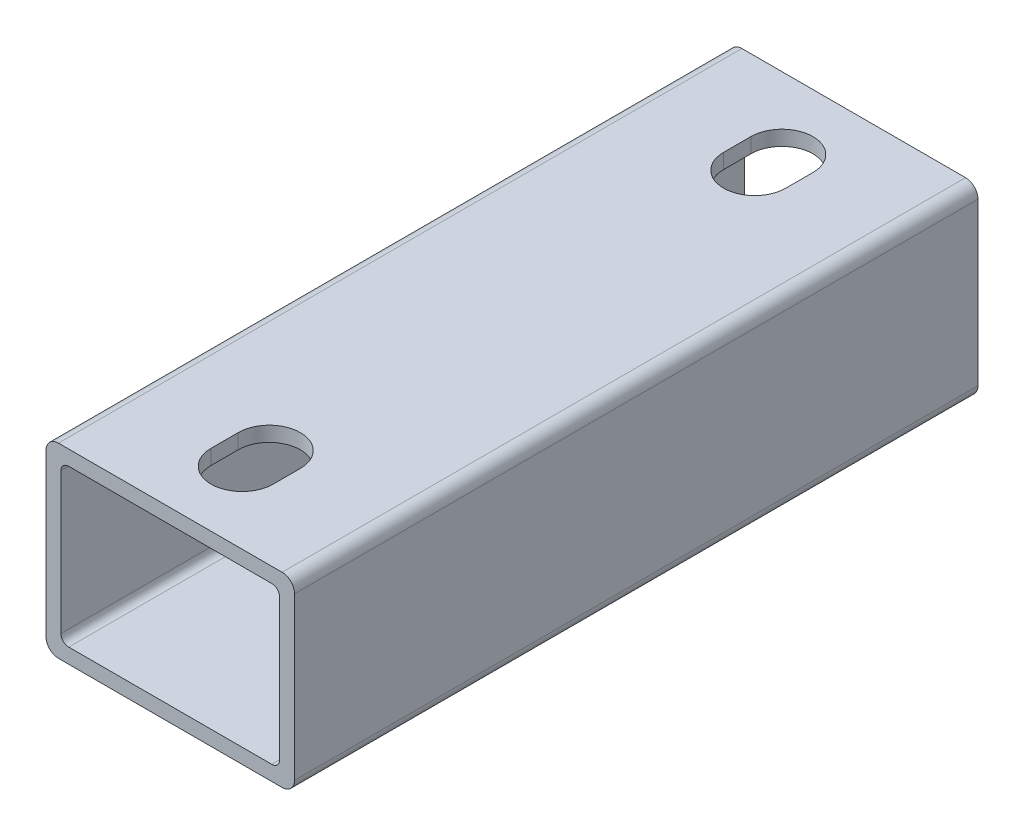
ISO-10303-21;
HEADER;
FILE_DESCRIPTION(('STEP AP214'),'2;1');
FILE_NAME('part.step','',(''),(''),'','','');
FILE_SCHEMA(('AUTOMOTIVE_DESIGN { 1 0 10303 214 1 1 1 1 }'));
ENDSEC;
DATA;
#1=APPLICATION_CONTEXT('core data for automotive mechanical design processes');
#2=APPLICATION_PROTOCOL_DEFINITION('international standard','automotive_design',2000,#1);
#3=PRODUCT_CONTEXT('',#1,'mechanical');
#4=PRODUCT('Part','Part','',(#3));
#5=PRODUCT_RELATED_PRODUCT_CATEGORY('part','',(#4));
#6=PRODUCT_DEFINITION_FORMATION('','',#4);
#7=PRODUCT_DEFINITION_CONTEXT('part definition',#1,'design');
#8=PRODUCT_DEFINITION('design','',#6,#7);
#9=PRODUCT_DEFINITION_SHAPE('','',#8);
#10=(LENGTH_UNIT() NAMED_UNIT(*) SI_UNIT(.MILLI.,.METRE.));
#11=(NAMED_UNIT(*) PLANE_ANGLE_UNIT() SI_UNIT($,.RADIAN.));
#12=(NAMED_UNIT(*) SI_UNIT($,.STERADIAN.) SOLID_ANGLE_UNIT());
#13=UNCERTAINTY_MEASURE_WITH_UNIT(LENGTH_MEASURE(1.E-05),#10,'distance_accuracy_value','');
#14=(GEOMETRIC_REPRESENTATION_CONTEXT(3) GLOBAL_UNCERTAINTY_ASSIGNED_CONTEXT((#13)) GLOBAL_UNIT_ASSIGNED_CONTEXT((#10,
#11,#12)) REPRESENTATION_CONTEXT('',''));
#15=CARTESIAN_POINT('',(0.,0.,0.));
#16=DIRECTION('',(0.,0.,1.));
#17=DIRECTION('',(1.,0.,0.));
#18=AXIS2_PLACEMENT_3D('',#15,#16,#17);
#19=CARTESIAN_POINT('',(22.86,-16.51,139.7));
#20=DIRECTION('',(0.,0.,1.));
#21=DIRECTION('',(1.,0.,0.));
#22=AXIS2_PLACEMENT_3D('',#19,#20,#21);
#23=PLANE('',#22);
#24=CARTESIAN_POINT('',(22.86,-16.51,139.7));
#25=DIRECTION('',(0.,0.,1.));
#26=DIRECTION('',(1.,0.,0.));
#27=AXIS2_PLACEMENT_3D('',#24,#25,#26);
#28=CIRCLE('',#27,2.53999999999999);
#29=CARTESIAN_POINT('',(22.86,-19.05,139.7));
#30=VERTEX_POINT('',#29);
#31=CARTESIAN_POINT('',(25.4,-16.51,139.7));
#32=VERTEX_POINT('',#31);
#33=EDGE_CURVE('E324',#30,#32,#28,.T.);
#34=ORIENTED_EDGE('',*,*,#33,.T.);
#35=DIRECTION('',(0.,1.,0.));
#36=VECTOR('',#35,1.);
#37=CARTESIAN_POINT('',(25.4,-16.51,139.7));
#38=LINE('',#37,#36);
#39=CARTESIAN_POINT('',(25.4,16.51,139.7));
#40=VERTEX_POINT('',#39);
#41=EDGE_CURVE('E327',#32,#40,#38,.T.);
#42=ORIENTED_EDGE('',*,*,#41,.T.);
#43=CARTESIAN_POINT('',(22.86,16.51,139.7));
#44=DIRECTION('',(0.,0.,1.));
#45=DIRECTION('',(1.,0.,0.));
#46=AXIS2_PLACEMENT_3D('',#43,#44,#45);
#47=CIRCLE('',#46,2.54);
#48=CARTESIAN_POINT('',(22.86,19.05,139.7));
#49=VERTEX_POINT('',#48);
#50=EDGE_CURVE('E330',#40,#49,#47,.T.);
#51=ORIENTED_EDGE('',*,*,#50,.T.);
#52=DIRECTION('',(-1.,0.,0.));
#53=VECTOR('',#52,1.);
#54=CARTESIAN_POINT('',(22.86,19.05,139.7));
#55=LINE('',#54,#53);
#56=CARTESIAN_POINT('',(-22.86,19.05,139.7));
#57=VERTEX_POINT('',#56);
#58=EDGE_CURVE('E332',#49,#57,#55,.T.);
#59=ORIENTED_EDGE('',*,*,#58,.T.);
#60=CARTESIAN_POINT('',(-22.86,16.51,139.7));
#61=DIRECTION('',(0.,0.,1.));
#62=DIRECTION('',(1.,0.,0.));
#63=AXIS2_PLACEMENT_3D('',#60,#61,#62);
#64=CIRCLE('',#63,2.54);
#65=CARTESIAN_POINT('',(-25.4,16.51,139.7));
#66=VERTEX_POINT('',#65);
#67=EDGE_CURVE('E334',#57,#66,#64,.T.);
#68=ORIENTED_EDGE('',*,*,#67,.T.);
#69=DIRECTION('',(0.,-1.,0.));
#70=VECTOR('',#69,1.);
#71=CARTESIAN_POINT('',(-25.4,-16.51,139.7));
#72=LINE('',#71,#70);
#73=CARTESIAN_POINT('',(-25.4,-16.51,139.7));
#74=VERTEX_POINT('',#73);
#75=EDGE_CURVE('E336',#66,#74,#72,.T.);
#76=ORIENTED_EDGE('',*,*,#75,.T.);
#77=CARTESIAN_POINT('',(-22.86,-16.51,139.7));
#78=DIRECTION('',(0.,0.,1.));
#79=DIRECTION('',(1.,0.,0.));
#80=AXIS2_PLACEMENT_3D('',#77,#78,#79);
#81=CIRCLE('',#80,2.54);
#82=CARTESIAN_POINT('',(-22.86,-19.05,139.7));
#83=VERTEX_POINT('',#82);
#84=EDGE_CURVE('E338',#74,#83,#81,.T.);
#85=ORIENTED_EDGE('',*,*,#84,.T.);
#86=DIRECTION('',(1.,0.,0.));
#87=VECTOR('',#86,1.);
#88=CARTESIAN_POINT('',(22.86,-19.05,139.7));
#89=LINE('',#88,#87);
#90=EDGE_CURVE('E340',#83,#30,#89,.T.);
#91=ORIENTED_EDGE('',*,*,#90,.T.);
#92=EDGE_LOOP('',(#34,#42,#51,#59,#68,#76,#85,#91));
#93=FACE_BOUND('',#92,.T.);
#94=DIRECTION('',(-1.,0.,0.));
#95=VECTOR('',#94,1.);
#96=CARTESIAN_POINT('',(20.7518,16.002,139.7));
#97=LINE('',#96,#95);
#98=CARTESIAN_POINT('',(20.7518,16.002,139.7));
#99=VERTEX_POINT('',#98);
#100=CARTESIAN_POINT('',(-20.7518,16.002,139.7));
#101=VERTEX_POINT('',#100);
#102=EDGE_CURVE('E267',#99,#101,#97,.T.);
#103=ORIENTED_EDGE('',*,*,#102,.F.);
#104=CARTESIAN_POINT('',(20.7518,14.4018,139.7));
#105=DIRECTION('',(0.,0.,1.));
#106=DIRECTION('',(1.,0.,0.));
#107=AXIS2_PLACEMENT_3D('',#104,#105,#106);
#108=CIRCLE('',#107,1.6002);
#109=CARTESIAN_POINT('',(22.352,14.4018,139.7));
#110=VERTEX_POINT('',#109);
#111=EDGE_CURVE('E265',#110,#99,#108,.T.);
#112=ORIENTED_EDGE('',*,*,#111,.F.);
#113=DIRECTION('',(0.,1.,0.));
#114=VECTOR('',#113,1.);
#115=CARTESIAN_POINT('',(22.352,14.4018,139.7));
#116=LINE('',#115,#114);
#117=CARTESIAN_POINT('',(22.352,-14.4018,139.7));
#118=VERTEX_POINT('',#117);
#119=EDGE_CURVE('E281',#118,#110,#116,.T.);
#120=ORIENTED_EDGE('',*,*,#119,.F.);
#121=CARTESIAN_POINT('',(20.7518,-14.4018,139.7));
#122=DIRECTION('',(0.,0.,1.));
#123=DIRECTION('',(1.,0.,0.));
#124=AXIS2_PLACEMENT_3D('',#121,#122,#123);
#125=CIRCLE('',#124,1.6002);
#126=CARTESIAN_POINT('',(20.7518,-16.002,139.7));
#127=VERTEX_POINT('',#126);
#128=EDGE_CURVE('E278',#127,#118,#125,.T.);
#129=ORIENTED_EDGE('',*,*,#128,.F.);
#130=DIRECTION('',(1.,0.,0.));
#131=VECTOR('',#130,1.);
#132=CARTESIAN_POINT('',(20.7518,-16.002,139.7));
#133=LINE('',#132,#131);
#134=CARTESIAN_POINT('',(-20.7518,-16.002,139.7));
#135=VERTEX_POINT('',#134);
#136=EDGE_CURVE('E276',#135,#127,#133,.T.);
#137=ORIENTED_EDGE('',*,*,#136,.F.);
#138=CARTESIAN_POINT('',(-20.7518,-14.4018,139.7));
#139=DIRECTION('',(0.,0.,1.));
#140=DIRECTION('',(1.,0.,0.));
#141=AXIS2_PLACEMENT_3D('',#138,#139,#140);
#142=CIRCLE('',#141,1.6002);
#143=CARTESIAN_POINT('',(-22.352,-14.4018,139.7));
#144=VERTEX_POINT('',#143);
#145=EDGE_CURVE('E274',#144,#135,#142,.T.);
#146=ORIENTED_EDGE('',*,*,#145,.F.);
#147=DIRECTION('',(0.,-1.,0.));
#148=VECTOR('',#147,1.);
#149=CARTESIAN_POINT('',(-22.352,14.4018,139.7));
#150=LINE('',#149,#148);
#151=CARTESIAN_POINT('',(-22.352,14.4018,139.7));
#152=VERTEX_POINT('',#151);
#153=EDGE_CURVE('E272',#152,#144,#150,.T.);
#154=ORIENTED_EDGE('',*,*,#153,.F.);
#155=CARTESIAN_POINT('',(-20.7518,14.4018,139.7));
#156=DIRECTION('',(0.,0.,1.));
#157=DIRECTION('',(1.,0.,0.));
#158=AXIS2_PLACEMENT_3D('',#155,#156,#157);
#159=CIRCLE('',#158,1.6002);
#160=EDGE_CURVE('E270',#101,#152,#159,.T.);
#161=ORIENTED_EDGE('',*,*,#160,.F.);
#162=EDGE_LOOP('',(#103,#112,#120,#129,#137,#146,#154,#161));
#163=FACE_BOUND('',#162,.T.);
#164=ADVANCED_FACE('F34',(#93,#163),#23,.T.);
#165=CARTESIAN_POINT('',(22.86,-16.51,0.));
#166=DIRECTION('',(0.,0.,1.));
#167=DIRECTION('',(1.,0.,0.));
#168=AXIS2_PLACEMENT_3D('',#165,#166,#167);
#169=PLANE('',#168);
#170=CARTESIAN_POINT('',(22.86,-16.51,0.));
#171=DIRECTION('',(0.,0.,1.));
#172=DIRECTION('',(1.,0.,0.));
#173=AXIS2_PLACEMENT_3D('',#170,#171,#172);
#174=CIRCLE('',#173,2.53999999999999);
#175=CARTESIAN_POINT('',(22.86,-19.05,0.));
#176=VERTEX_POINT('',#175);
#177=CARTESIAN_POINT('',(25.4,-16.51,0.));
#178=VERTEX_POINT('',#177);
#179=EDGE_CURVE('E323',#176,#178,#174,.T.);
#180=ORIENTED_EDGE('',*,*,#179,.F.);
#181=DIRECTION('',(1.,0.,0.));
#182=VECTOR('',#181,1.);
#183=CARTESIAN_POINT('',(22.86,-19.05,0.));
#184=LINE('',#183,#182);
#185=CARTESIAN_POINT('',(-22.86,-19.05,0.));
#186=VERTEX_POINT('',#185);
#187=EDGE_CURVE('E328',#186,#176,#184,.T.);
#188=ORIENTED_EDGE('',*,*,#187,.F.);
#189=CARTESIAN_POINT('',(-22.86,-16.51,0.));
#190=DIRECTION('',(0.,0.,1.));
#191=DIRECTION('',(1.,0.,0.));
#192=AXIS2_PLACEMENT_3D('',#189,#190,#191);
#193=CIRCLE('',#192,2.54);
#194=CARTESIAN_POINT('',(-25.4,-16.51,0.));
#195=VERTEX_POINT('',#194);
#196=EDGE_CURVE('E355',#195,#186,#193,.T.);
#197=ORIENTED_EDGE('',*,*,#196,.F.);
#198=DIRECTION('',(0.,-1.,0.));
#199=VECTOR('',#198,1.);
#200=CARTESIAN_POINT('',(-25.4,-16.51,0.));
#201=LINE('',#200,#199);
#202=CARTESIAN_POINT('',(-25.4,16.51,0.));
#203=VERTEX_POINT('',#202);
#204=EDGE_CURVE('E353',#203,#195,#201,.T.);
#205=ORIENTED_EDGE('',*,*,#204,.F.);
#206=CARTESIAN_POINT('',(-22.86,16.51,0.));
#207=DIRECTION('',(0.,0.,1.));
#208=DIRECTION('',(1.,0.,0.));
#209=AXIS2_PLACEMENT_3D('',#206,#207,#208);
#210=CIRCLE('',#209,2.54);
#211=CARTESIAN_POINT('',(-22.86,19.05,0.));
#212=VERTEX_POINT('',#211);
#213=EDGE_CURVE('E351',#212,#203,#210,.T.);
#214=ORIENTED_EDGE('',*,*,#213,.F.);
#215=DIRECTION('',(-1.,0.,0.));
#216=VECTOR('',#215,1.);
#217=CARTESIAN_POINT('',(22.86,19.05,0.));
#218=LINE('',#217,#216);
#219=CARTESIAN_POINT('',(22.86,19.05,0.));
#220=VERTEX_POINT('',#219);
#221=EDGE_CURVE('E349',#220,#212,#218,.T.);
#222=ORIENTED_EDGE('',*,*,#221,.F.);
#223=CARTESIAN_POINT('',(22.86,16.51,0.));
#224=DIRECTION('',(0.,0.,1.));
#225=DIRECTION('',(1.,0.,0.));
#226=AXIS2_PLACEMENT_3D('',#223,#224,#225);
#227=CIRCLE('',#226,2.54);
#228=CARTESIAN_POINT('',(25.4,16.51,0.));
#229=VERTEX_POINT('',#228);
#230=EDGE_CURVE('E347',#229,#220,#227,.T.);
#231=ORIENTED_EDGE('',*,*,#230,.F.);
#232=DIRECTION('',(0.,1.,0.));
#233=VECTOR('',#232,1.);
#234=CARTESIAN_POINT('',(25.4,-16.51,0.));
#235=LINE('',#234,#233);
#236=EDGE_CURVE('E345',#178,#229,#235,.T.);
#237=ORIENTED_EDGE('',*,*,#236,.F.);
#238=EDGE_LOOP('',(#180,#188,#197,#205,#214,#222,#231,#237));
#239=FACE_BOUND('',#238,.T.);
#240=CARTESIAN_POINT('',(20.7518,14.4018,0.));
#241=DIRECTION('',(0.,0.,1.));
#242=DIRECTION('',(1.,0.,0.));
#243=AXIS2_PLACEMENT_3D('',#240,#241,#242);
#244=CIRCLE('',#243,1.6002);
#245=CARTESIAN_POINT('',(22.352,14.4018,0.));
#246=VERTEX_POINT('',#245);
#247=CARTESIAN_POINT('',(20.7518,16.002,0.));
#248=VERTEX_POINT('',#247);
#249=EDGE_CURVE('E213',#246,#248,#244,.T.);
#250=ORIENTED_EDGE('',*,*,#249,.T.);
#251=DIRECTION('',(-1.,0.,0.));
#252=VECTOR('',#251,1.);
#253=CARTESIAN_POINT('',(20.7518,16.002,0.));
#254=LINE('',#253,#252);
#255=CARTESIAN_POINT('',(-20.7518,16.002,0.));
#256=VERTEX_POINT('',#255);
#257=EDGE_CURVE('E286',#248,#256,#254,.T.);
#258=ORIENTED_EDGE('',*,*,#257,.T.);
#259=CARTESIAN_POINT('',(-20.7518,14.4018,0.));
#260=DIRECTION('',(0.,0.,1.));
#261=DIRECTION('',(1.,0.,0.));
#262=AXIS2_PLACEMENT_3D('',#259,#260,#261);
#263=CIRCLE('',#262,1.6002);
#264=CARTESIAN_POINT('',(-22.352,14.4018,0.));
#265=VERTEX_POINT('',#264);
#266=EDGE_CURVE('E289',#256,#265,#263,.T.);
#267=ORIENTED_EDGE('',*,*,#266,.T.);
#268=DIRECTION('',(0.,-1.,0.));
#269=VECTOR('',#268,1.);
#270=CARTESIAN_POINT('',(-22.352,14.4018,0.));
#271=LINE('',#270,#269);
#272=CARTESIAN_POINT('',(-22.352,-14.4018,0.));
#273=VERTEX_POINT('',#272);
#274=EDGE_CURVE('E292',#265,#273,#271,.T.);
#275=ORIENTED_EDGE('',*,*,#274,.T.);
#276=CARTESIAN_POINT('',(-20.7518,-14.4018,0.));
#277=DIRECTION('',(0.,0.,1.));
#278=DIRECTION('',(1.,0.,0.));
#279=AXIS2_PLACEMENT_3D('',#276,#277,#278);
#280=CIRCLE('',#279,1.6002);
#281=CARTESIAN_POINT('',(-20.7518,-16.002,0.));
#282=VERTEX_POINT('',#281);
#283=EDGE_CURVE('E295',#273,#282,#280,.T.);
#284=ORIENTED_EDGE('',*,*,#283,.T.);
#285=DIRECTION('',(1.,0.,0.));
#286=VECTOR('',#285,1.);
#287=CARTESIAN_POINT('',(20.7518,-16.002,0.));
#288=LINE('',#287,#286);
#289=CARTESIAN_POINT('',(20.7518,-16.002,0.));
#290=VERTEX_POINT('',#289);
#291=EDGE_CURVE('E298',#282,#290,#288,.T.);
#292=ORIENTED_EDGE('',*,*,#291,.T.);
#293=CARTESIAN_POINT('',(20.7518,-14.4018,0.));
#294=DIRECTION('',(0.,0.,1.));
#295=DIRECTION('',(1.,0.,0.));
#296=AXIS2_PLACEMENT_3D('',#293,#294,#295);
#297=CIRCLE('',#296,1.6002);
#298=CARTESIAN_POINT('',(22.352,-14.4018,0.));
#299=VERTEX_POINT('',#298);
#300=EDGE_CURVE('E301',#290,#299,#297,.T.);
#301=ORIENTED_EDGE('',*,*,#300,.T.);
#302=DIRECTION('',(0.,1.,0.));
#303=VECTOR('',#302,1.);
#304=CARTESIAN_POINT('',(22.352,14.4018,0.));
#305=LINE('',#304,#303);
#306=EDGE_CURVE('E268',#299,#246,#305,.T.);
#307=ORIENTED_EDGE('',*,*,#306,.T.);
#308=EDGE_LOOP('',(#250,#258,#267,#275,#284,#292,#301,#307));
#309=FACE_BOUND('',#308,.T.);
#310=ADVANCED_FACE('F385',(#239,#309),#169,.F.);
#311=CARTESIAN_POINT('',(22.86,-16.51,139.7));
#312=DIRECTION('',(0.,0.,-1.));
#313=DIRECTION('',(-1.,0.,0.));
#314=AXIS2_PLACEMENT_3D('',#311,#312,#313);
#315=CYLINDRICAL_SURFACE('',#314,2.53999999999999);
#316=ORIENTED_EDGE('',*,*,#179,.T.);
#317=DIRECTION('',(0.,0.,-1.));
#318=VECTOR('',#317,1.);
#319=CARTESIAN_POINT('',(25.4,-16.51,139.7));
#320=LINE('',#319,#318);
#321=EDGE_CURVE('E11',#32,#178,#320,.T.);
#322=ORIENTED_EDGE('',*,*,#321,.F.);
#323=ORIENTED_EDGE('',*,*,#33,.F.);
#324=DIRECTION('',(0.,0.,-1.));
#325=VECTOR('',#324,1.);
#326=CARTESIAN_POINT('',(22.86,-19.05,139.7));
#327=LINE('',#326,#325);
#328=EDGE_CURVE('E342',#30,#176,#327,.T.);
#329=ORIENTED_EDGE('',*,*,#328,.T.);
#330=EDGE_LOOP('',(#316,#322,#323,#329));
#331=FACE_BOUND('',#330,.T.);
#332=ADVANCED_FACE('F36',(#331),#315,.T.);
#333=CARTESIAN_POINT('',(25.4,-16.51,139.7));
#334=DIRECTION('',(-1.,0.,0.));
#335=DIRECTION('',(0.,0.,1.));
#336=AXIS2_PLACEMENT_3D('',#333,#334,#335);
#337=PLANE('',#336);
#338=ORIENTED_EDGE('',*,*,#236,.T.);
#339=DIRECTION('',(0.,0.,-1.));
#340=VECTOR('',#339,1.);
#341=CARTESIAN_POINT('',(25.4,16.51,139.7));
#342=LINE('',#341,#340);
#343=EDGE_CURVE('E42',#40,#229,#342,.T.);
#344=ORIENTED_EDGE('',*,*,#343,.F.);
#345=ORIENTED_EDGE('',*,*,#41,.F.);
#346=ORIENTED_EDGE('',*,*,#321,.T.);
#347=EDGE_LOOP('',(#338,#344,#345,#346));
#348=FACE_BOUND('',#347,.T.);
#349=ADVANCED_FACE('F402',(#348),#337,.F.);
#350=CARTESIAN_POINT('',(22.86,16.51,139.7));
#351=DIRECTION('',(0.,0.,-1.));
#352=DIRECTION('',(-1.,0.,0.));
#353=AXIS2_PLACEMENT_3D('',#350,#351,#352);
#354=CYLINDRICAL_SURFACE('',#353,2.54);
#355=ORIENTED_EDGE('',*,*,#230,.T.);
#356=DIRECTION('',(0.,0.,-1.));
#357=VECTOR('',#356,1.);
#358=CARTESIAN_POINT('',(22.86,19.05,139.7));
#359=LINE('',#358,#357);
#360=EDGE_CURVE('E372',#49,#220,#359,.T.);
#361=ORIENTED_EDGE('',*,*,#360,.F.);
#362=ORIENTED_EDGE('',*,*,#50,.F.);
#363=ORIENTED_EDGE('',*,*,#343,.T.);
#364=EDGE_LOOP('',(#355,#361,#362,#363));
#365=FACE_BOUND('',#364,.T.);
#366=ADVANCED_FACE('F379',(#365),#354,.T.);
#367=CARTESIAN_POINT('',(22.86,19.05,139.7));
#368=DIRECTION('',(0.,-1.,0.));
#369=DIRECTION('',(0.,0.,-1.));
#370=AXIS2_PLACEMENT_3D('',#367,#368,#369);
#371=PLANE('',#370);
#372=DIRECTION('',(0.,0.,1.));
#373=VECTOR('',#372,1.);
#374=CARTESIAN_POINT('',(-6.35000000000006,19.05,20.2406250000001));
#375=LINE('',#374,#373);
#376=CARTESIAN_POINT('',(-6.35000000000006,19.05,14.6843750000001));
#377=VERTEX_POINT('',#376);
#378=CARTESIAN_POINT('',(-6.35,19.05,20.2406250000001));
#379=VERTEX_POINT('',#378);
#380=EDGE_CURVE('E220',#377,#379,#375,.T.);
#381=ORIENTED_EDGE('',*,*,#380,.F.);
#382=CARTESIAN_POINT('',(0.,19.05,14.6843750000001));
#383=DIRECTION('',(0.,1.,0.));
#384=DIRECTION('',(0.,0.,1.));
#385=AXIS2_PLACEMENT_3D('',#382,#383,#384);
#386=CIRCLE('',#385,6.35000000000007);
#387=CARTESIAN_POINT('',(6.35000000000009,19.05,14.6843750000001));
#388=VERTEX_POINT('',#387);
#389=EDGE_CURVE('E49',#388,#377,#386,.T.);
#390=ORIENTED_EDGE('',*,*,#389,.F.);
#391=DIRECTION('',(0.,0.,-1.));
#392=VECTOR('',#391,1.);
#393=CARTESIAN_POINT('',(6.35000000000009,19.05,14.6843750000001));
#394=LINE('',#393,#392);
#395=CARTESIAN_POINT('',(6.35000000000004,19.05,20.2406250000001));
#396=VERTEX_POINT('',#395);
#397=EDGE_CURVE('E206',#396,#388,#394,.T.);
#398=ORIENTED_EDGE('',*,*,#397,.F.);
#399=CARTESIAN_POINT('',(0.,19.05,20.2406250000001));
#400=DIRECTION('',(0.,1.,0.));
#401=DIRECTION('',(0.,0.,1.));
#402=AXIS2_PLACEMENT_3D('',#399,#400,#401);
#403=CIRCLE('',#402,6.35000000000005);
#404=EDGE_CURVE('E214',#379,#396,#403,.T.);
#405=ORIENTED_EDGE('',*,*,#404,.F.);
#406=EDGE_LOOP('',(#381,#390,#398,#405));
#407=FACE_BOUND('',#406,.T.);
#408=DIRECTION('',(0.,0.,-1.));
#409=VECTOR('',#408,1.);
#410=CARTESIAN_POINT('',(6.3500000000001,19.05,119.459375));
#411=LINE('',#410,#409);
#412=CARTESIAN_POINT('',(6.35000000000005,19.05,125.015625));
#413=VERTEX_POINT('',#412);
#414=CARTESIAN_POINT('',(6.35000000000013,19.05,119.459375));
#415=VERTEX_POINT('',#414);
#416=EDGE_CURVE('E246',#413,#415,#411,.T.);
#417=ORIENTED_EDGE('',*,*,#416,.F.);
#418=CARTESIAN_POINT('',(0.,19.05,125.015625));
#419=DIRECTION('',(0.,1.,0.));
#420=DIRECTION('',(0.,0.,1.));
#421=AXIS2_PLACEMENT_3D('',#418,#419,#420);
#422=CIRCLE('',#421,6.35000000000005);
#423=CARTESIAN_POINT('',(-6.35000000000004,19.05,125.015625));
#424=VERTEX_POINT('',#423);
#425=EDGE_CURVE('E57',#424,#413,#422,.T.);
#426=ORIENTED_EDGE('',*,*,#425,.F.);
#427=DIRECTION('',(0.,0.,1.));
#428=VECTOR('',#427,1.);
#429=CARTESIAN_POINT('',(-6.35000000000004,19.05,125.015625));
#430=LINE('',#429,#428);
#431=CARTESIAN_POINT('',(-6.35000000000004,19.05,119.459375));
#432=VERTEX_POINT('',#431);
#433=EDGE_CURVE('E230',#432,#424,#430,.T.);
#434=ORIENTED_EDGE('',*,*,#433,.F.);
#435=CARTESIAN_POINT('',(0.,19.05,119.459375));
#436=DIRECTION('',(0.,1.,0.));
#437=DIRECTION('',(0.,0.,1.));
#438=AXIS2_PLACEMENT_3D('',#435,#436,#437);
#439=CIRCLE('',#438,6.35000000000007);
#440=EDGE_CURVE('E243',#415,#432,#439,.T.);
#441=ORIENTED_EDGE('',*,*,#440,.F.);
#442=EDGE_LOOP('',(#417,#426,#434,#441));
#443=FACE_BOUND('',#442,.T.);
#444=ORIENTED_EDGE('',*,*,#221,.T.);
#445=DIRECTION('',(0.,0.,-1.));
#446=VECTOR('',#445,1.);
#447=CARTESIAN_POINT('',(-22.86,19.05,139.7));
#448=LINE('',#447,#446);
#449=EDGE_CURVE('E369',#57,#212,#448,.T.);
#450=ORIENTED_EDGE('',*,*,#449,.F.);
#451=ORIENTED_EDGE('',*,*,#58,.F.);
#452=ORIENTED_EDGE('',*,*,#360,.T.);
#453=EDGE_LOOP('',(#444,#450,#451,#452));
#454=FACE_BOUND('',#453,.T.);
#455=ADVANCED_FACE('F217',(#407,#443,#454),#371,.F.);
#456=CARTESIAN_POINT('',(-22.86,16.51,139.7));
#457=DIRECTION('',(0.,0.,-1.));
#458=DIRECTION('',(-1.,0.,0.));
#459=AXIS2_PLACEMENT_3D('',#456,#457,#458);
#460=CYLINDRICAL_SURFACE('',#459,2.54);
#461=ORIENTED_EDGE('',*,*,#213,.T.);
#462=DIRECTION('',(0.,0.,-1.));
#463=VECTOR('',#462,1.);
#464=CARTESIAN_POINT('',(-25.4,16.51,139.7));
#465=LINE('',#464,#463);
#466=EDGE_CURVE('E366',#66,#203,#465,.T.);
#467=ORIENTED_EDGE('',*,*,#466,.F.);
#468=ORIENTED_EDGE('',*,*,#67,.F.);
#469=ORIENTED_EDGE('',*,*,#449,.T.);
#470=EDGE_LOOP('',(#461,#467,#468,#469));
#471=FACE_BOUND('',#470,.T.);
#472=ADVANCED_FACE('F394',(#471),#460,.T.);
#473=CARTESIAN_POINT('',(-25.4,-16.51,139.7));
#474=DIRECTION('',(1.,0.,0.));
#475=DIRECTION('',(0.,1.,0.));
#476=AXIS2_PLACEMENT_3D('',#473,#474,#475);
#477=PLANE('',#476);
#478=ORIENTED_EDGE('',*,*,#204,.T.);
#479=DIRECTION('',(0.,0.,-1.));
#480=VECTOR('',#479,1.);
#481=CARTESIAN_POINT('',(-25.4,-16.51,139.7));
#482=LINE('',#481,#480);
#483=EDGE_CURVE('E363',#74,#195,#482,.T.);
#484=ORIENTED_EDGE('',*,*,#483,.F.);
#485=ORIENTED_EDGE('',*,*,#75,.F.);
#486=ORIENTED_EDGE('',*,*,#466,.T.);
#487=EDGE_LOOP('',(#478,#484,#485,#486));
#488=FACE_BOUND('',#487,.T.);
#489=ADVANCED_FACE('F415',(#488),#477,.F.);
#490=CARTESIAN_POINT('',(-22.86,-16.51,139.7));
#491=DIRECTION('',(0.,0.,-1.));
#492=DIRECTION('',(-1.,0.,0.));
#493=AXIS2_PLACEMENT_3D('',#490,#491,#492);
#494=CYLINDRICAL_SURFACE('',#493,2.54);
#495=ORIENTED_EDGE('',*,*,#196,.T.);
#496=DIRECTION('',(0.,0.,-1.));
#497=VECTOR('',#496,1.);
#498=CARTESIAN_POINT('',(-22.86,-19.05,139.7));
#499=LINE('',#498,#497);
#500=EDGE_CURVE('E360',#83,#186,#499,.T.);
#501=ORIENTED_EDGE('',*,*,#500,.F.);
#502=ORIENTED_EDGE('',*,*,#84,.F.);
#503=ORIENTED_EDGE('',*,*,#483,.T.);
#504=EDGE_LOOP('',(#495,#501,#502,#503));
#505=FACE_BOUND('',#504,.T.);
#506=ADVANCED_FACE('F413',(#505),#494,.T.);
#507=CARTESIAN_POINT('',(22.86,-19.05,139.7));
#508=DIRECTION('',(0.,1.,0.));
#509=DIRECTION('',(-1.,0.,0.));
#510=AXIS2_PLACEMENT_3D('',#507,#508,#509);
#511=PLANE('',#510);
#512=ORIENTED_EDGE('',*,*,#187,.T.);
#513=ORIENTED_EDGE('',*,*,#328,.F.);
#514=ORIENTED_EDGE('',*,*,#90,.F.);
#515=ORIENTED_EDGE('',*,*,#500,.T.);
#516=EDGE_LOOP('',(#512,#513,#514,#515));
#517=FACE_BOUND('',#516,.T.);
#518=ADVANCED_FACE('F408',(#517),#511,.F.);
#519=CARTESIAN_POINT('',(20.7518,14.4018,139.7));
#520=DIRECTION('',(0.,0.,-1.));
#521=DIRECTION('',(-1.,0.,0.));
#522=AXIS2_PLACEMENT_3D('',#519,#520,#521);
#523=CYLINDRICAL_SURFACE('',#522,1.6002);
#524=ORIENTED_EDGE('',*,*,#249,.F.);
#525=DIRECTION('',(0.,0.,-1.));
#526=VECTOR('',#525,1.);
#527=CARTESIAN_POINT('',(22.352,14.4018,139.7));
#528=LINE('',#527,#526);
#529=EDGE_CURVE('E283',#110,#246,#528,.T.);
#530=ORIENTED_EDGE('',*,*,#529,.F.);
#531=ORIENTED_EDGE('',*,*,#111,.T.);
#532=DIRECTION('',(0.,0.,-1.));
#533=VECTOR('',#532,1.);
#534=CARTESIAN_POINT('',(20.7518,16.002,139.7));
#535=LINE('',#534,#533);
#536=EDGE_CURVE('E320',#99,#248,#535,.T.);
#537=ORIENTED_EDGE('',*,*,#536,.T.);
#538=EDGE_LOOP('',(#524,#530,#531,#537));
#539=FACE_BOUND('',#538,.T.);
#540=ADVANCED_FACE('F431',(#539),#523,.F.);
#541=CARTESIAN_POINT('',(20.7518,16.002,139.7));
#542=DIRECTION('',(0.,-1.,0.));
#543=DIRECTION('',(1.,0.,0.));
#544=AXIS2_PLACEMENT_3D('',#541,#542,#543);
#545=PLANE('',#544);
#546=CARTESIAN_POINT('',(0.,16.002,14.6843750000001));
#547=DIRECTION('',(0.,-1.,0.));
#548=DIRECTION('',(1.,0.,0.));
#549=AXIS2_PLACEMENT_3D('',#546,#547,#548);
#550=CIRCLE('',#549,6.35000000000007);
#551=CARTESIAN_POINT('',(6.35000000000009,16.002,14.6843750000001));
#552=VERTEX_POINT('',#551);
#553=CARTESIAN_POINT('',(-6.35000000000006,16.002,14.6843750000001));
#554=VERTEX_POINT('',#553);
#555=EDGE_CURVE('E199',#552,#554,#550,.F.);
#556=ORIENTED_EDGE('',*,*,#555,.T.);
#557=DIRECTION('',(0.,0.,1.));
#558=VECTOR('',#557,1.);
#559=CARTESIAN_POINT('',(-6.35000000000006,16.002,20.2406250000001));
#560=LINE('',#559,#558);
#561=CARTESIAN_POINT('',(-6.35000000000006,16.002,20.2406250000001));
#562=VERTEX_POINT('',#561);
#563=EDGE_CURVE('E224',#554,#562,#560,.T.);
#564=ORIENTED_EDGE('',*,*,#563,.T.);
#565=CARTESIAN_POINT('',(0.,16.002,20.2406250000001));
#566=DIRECTION('',(0.,-1.,0.));
#567=DIRECTION('',(1.,0.,0.));
#568=AXIS2_PLACEMENT_3D('',#565,#566,#567);
#569=CIRCLE('',#568,6.35000000000005);
#570=CARTESIAN_POINT('',(6.35000000000009,16.002,20.2406250000001));
#571=VERTEX_POINT('',#570);
#572=EDGE_CURVE('E202',#562,#571,#569,.F.);
#573=ORIENTED_EDGE('',*,*,#572,.T.);
#574=DIRECTION('',(0.,0.,-1.));
#575=VECTOR('',#574,1.);
#576=CARTESIAN_POINT('',(6.35000000000009,16.002,14.6843750000001));
#577=LINE('',#576,#575);
#578=EDGE_CURVE('E203',#571,#552,#577,.T.);
#579=ORIENTED_EDGE('',*,*,#578,.T.);
#580=EDGE_LOOP('',(#556,#564,#573,#579));
#581=FACE_BOUND('',#580,.T.);
#582=CARTESIAN_POINT('',(0.,16.002,125.015625));
#583=DIRECTION('',(0.,-1.,0.));
#584=DIRECTION('',(1.,0.,0.));
#585=AXIS2_PLACEMENT_3D('',#582,#583,#584);
#586=CIRCLE('',#585,6.35000000000005);
#587=CARTESIAN_POINT('',(-6.35000000000004,16.002,125.015625));
#588=VERTEX_POINT('',#587);
#589=CARTESIAN_POINT('',(6.35000000000005,16.002,125.015625));
#590=VERTEX_POINT('',#589);
#591=EDGE_CURVE('E250',#588,#590,#586,.F.);
#592=ORIENTED_EDGE('',*,*,#591,.T.);
#593=DIRECTION('',(0.,0.,-1.));
#594=VECTOR('',#593,1.);
#595=CARTESIAN_POINT('',(6.3500000000001,16.002,119.459375));
#596=LINE('',#595,#594);
#597=CARTESIAN_POINT('',(6.3500000000001,16.002,119.459375));
#598=VERTEX_POINT('',#597);
#599=EDGE_CURVE('E236',#590,#598,#596,.T.);
#600=ORIENTED_EDGE('',*,*,#599,.T.);
#601=CARTESIAN_POINT('',(0.,16.002,119.459375));
#602=DIRECTION('',(0.,-1.,0.));
#603=DIRECTION('',(1.,0.,0.));
#604=AXIS2_PLACEMENT_3D('',#601,#602,#603);
#605=CIRCLE('',#604,6.35000000000007);
#606=CARTESIAN_POINT('',(-6.35000000000002,16.002,119.459375));
#607=VERTEX_POINT('',#606);
#608=EDGE_CURVE('E258',#598,#607,#605,.F.);
#609=ORIENTED_EDGE('',*,*,#608,.T.);
#610=DIRECTION('',(0.,0.,1.));
#611=VECTOR('',#610,1.);
#612=CARTESIAN_POINT('',(-6.35000000000004,16.002,125.015625));
#613=LINE('',#612,#611);
#614=EDGE_CURVE('E254',#607,#588,#613,.T.);
#615=ORIENTED_EDGE('',*,*,#614,.T.);
#616=EDGE_LOOP('',(#592,#600,#609,#615));
#617=FACE_BOUND('',#616,.T.);
#618=ORIENTED_EDGE('',*,*,#257,.F.);
#619=ORIENTED_EDGE('',*,*,#536,.F.);
#620=ORIENTED_EDGE('',*,*,#102,.T.);
#621=DIRECTION('',(0.,0.,-1.));
#622=VECTOR('',#621,1.);
#623=CARTESIAN_POINT('',(-20.7518,16.002,139.7));
#624=LINE('',#623,#622);
#625=EDGE_CURVE('E318',#101,#256,#624,.T.);
#626=ORIENTED_EDGE('',*,*,#625,.T.);
#627=EDGE_LOOP('',(#618,#619,#620,#626));
#628=FACE_BOUND('',#627,.T.);
#629=ADVANCED_FACE('F438',(#581,#617,#628),#545,.T.);
#630=CARTESIAN_POINT('',(-20.7518,14.4018,139.7));
#631=DIRECTION('',(0.,0.,-1.));
#632=DIRECTION('',(-1.,0.,0.));
#633=AXIS2_PLACEMENT_3D('',#630,#631,#632);
#634=CYLINDRICAL_SURFACE('',#633,1.6002);
#635=ORIENTED_EDGE('',*,*,#266,.F.);
#636=ORIENTED_EDGE('',*,*,#625,.F.);
#637=ORIENTED_EDGE('',*,*,#160,.T.);
#638=DIRECTION('',(0.,0.,-1.));
#639=VECTOR('',#638,1.);
#640=CARTESIAN_POINT('',(-22.352,14.4018,139.7));
#641=LINE('',#640,#639);
#642=EDGE_CURVE('E316',#152,#265,#641,.T.);
#643=ORIENTED_EDGE('',*,*,#642,.T.);
#644=EDGE_LOOP('',(#635,#636,#637,#643));
#645=FACE_BOUND('',#644,.T.);
#646=ADVANCED_FACE('F443',(#645),#634,.F.);
#647=CARTESIAN_POINT('',(-22.352,14.4018,139.7));
#648=DIRECTION('',(1.,0.,0.));
#649=DIRECTION('',(0.,1.,0.));
#650=AXIS2_PLACEMENT_3D('',#647,#648,#649);
#651=PLANE('',#650);
#652=ORIENTED_EDGE('',*,*,#274,.F.);
#653=ORIENTED_EDGE('',*,*,#642,.F.);
#654=ORIENTED_EDGE('',*,*,#153,.T.);
#655=DIRECTION('',(0.,0.,-1.));
#656=VECTOR('',#655,1.);
#657=CARTESIAN_POINT('',(-22.352,-14.4018,139.7));
#658=LINE('',#657,#656);
#659=EDGE_CURVE('E314',#144,#273,#658,.T.);
#660=ORIENTED_EDGE('',*,*,#659,.T.);
#661=EDGE_LOOP('',(#652,#653,#654,#660));
#662=FACE_BOUND('',#661,.T.);
#663=ADVANCED_FACE('F469',(#662),#651,.T.);
#664=CARTESIAN_POINT('',(-20.7518,-14.4018,139.7));
#665=DIRECTION('',(0.,0.,-1.));
#666=DIRECTION('',(-1.,0.,0.));
#667=AXIS2_PLACEMENT_3D('',#664,#665,#666);
#668=CYLINDRICAL_SURFACE('',#667,1.6002);
#669=ORIENTED_EDGE('',*,*,#283,.F.);
#670=ORIENTED_EDGE('',*,*,#659,.F.);
#671=ORIENTED_EDGE('',*,*,#145,.T.);
#672=DIRECTION('',(0.,0.,-1.));
#673=VECTOR('',#672,1.);
#674=CARTESIAN_POINT('',(-20.7518,-16.002,139.7));
#675=LINE('',#674,#673);
#676=EDGE_CURVE('E312',#135,#282,#675,.T.);
#677=ORIENTED_EDGE('',*,*,#676,.T.);
#678=EDGE_LOOP('',(#669,#670,#671,#677));
#679=FACE_BOUND('',#678,.T.);
#680=ADVANCED_FACE('F474',(#679),#668,.F.);
#681=CARTESIAN_POINT('',(20.7518,-16.002,139.7));
#682=DIRECTION('',(0.,1.,0.));
#683=DIRECTION('',(-1.,0.,0.));
#684=AXIS2_PLACEMENT_3D('',#681,#682,#683);
#685=PLANE('',#684);
#686=ORIENTED_EDGE('',*,*,#291,.F.);
#687=ORIENTED_EDGE('',*,*,#676,.F.);
#688=ORIENTED_EDGE('',*,*,#136,.T.);
#689=DIRECTION('',(0.,0.,-1.));
#690=VECTOR('',#689,1.);
#691=CARTESIAN_POINT('',(20.7518,-16.002,139.7));
#692=LINE('',#691,#690);
#693=EDGE_CURVE('E310',#127,#290,#692,.T.);
#694=ORIENTED_EDGE('',*,*,#693,.T.);
#695=EDGE_LOOP('',(#686,#687,#688,#694));
#696=FACE_BOUND('',#695,.T.);
#697=ADVANCED_FACE('F477',(#696),#685,.T.);
#698=CARTESIAN_POINT('',(20.7518,-14.4018,139.7));
#699=DIRECTION('',(0.,0.,-1.));
#700=DIRECTION('',(-1.,0.,0.));
#701=AXIS2_PLACEMENT_3D('',#698,#699,#700);
#702=CYLINDRICAL_SURFACE('',#701,1.6002);
#703=ORIENTED_EDGE('',*,*,#300,.F.);
#704=ORIENTED_EDGE('',*,*,#693,.F.);
#705=ORIENTED_EDGE('',*,*,#128,.T.);
#706=DIRECTION('',(0.,0.,-1.));
#707=VECTOR('',#706,1.);
#708=CARTESIAN_POINT('',(22.352,-14.4018,139.7));
#709=LINE('',#708,#707);
#710=EDGE_CURVE('E308',#118,#299,#709,.T.);
#711=ORIENTED_EDGE('',*,*,#710,.T.);
#712=EDGE_LOOP('',(#703,#704,#705,#711));
#713=FACE_BOUND('',#712,.T.);
#714=ADVANCED_FACE('F456',(#713),#702,.F.);
#715=CARTESIAN_POINT('',(22.352,14.4018,139.7));
#716=DIRECTION('',(-1.,0.,0.));
#717=DIRECTION('',(0.,-1.,0.));
#718=AXIS2_PLACEMENT_3D('',#715,#716,#717);
#719=PLANE('',#718);
#720=ORIENTED_EDGE('',*,*,#306,.F.);
#721=ORIENTED_EDGE('',*,*,#710,.F.);
#722=ORIENTED_EDGE('',*,*,#119,.T.);
#723=ORIENTED_EDGE('',*,*,#529,.T.);
#724=EDGE_LOOP('',(#720,#721,#722,#723));
#725=FACE_BOUND('',#724,.T.);
#726=ADVANCED_FACE('F450',(#725),#719,.T.);
#727=CARTESIAN_POINT('',(0.,-19.051,125.015625));
#728=DIRECTION('',(0.,1.,0.));
#729=DIRECTION('',(-1.,0.,0.));
#730=AXIS2_PLACEMENT_3D('',#727,#728,#729);
#731=CYLINDRICAL_SURFACE('',#730,6.35000000000005);
#732=DIRECTION('',(0.,1.,0.));
#733=VECTOR('',#732,1.);
#734=CARTESIAN_POINT('',(-6.35000000000004,-19.051,125.015625));
#735=LINE('',#734,#733);
#736=EDGE_CURVE('E257',#588,#424,#735,.T.);
#737=ORIENTED_EDGE('',*,*,#736,.T.);
#738=ORIENTED_EDGE('',*,*,#425,.T.);
#739=DIRECTION('',(0.,1.,0.));
#740=VECTOR('',#739,1.);
#741=CARTESIAN_POINT('',(6.35000000000006,-19.051,125.015625));
#742=LINE('',#741,#740);
#743=EDGE_CURVE('E253',#590,#413,#742,.T.);
#744=ORIENTED_EDGE('',*,*,#743,.F.);
#745=ORIENTED_EDGE('',*,*,#591,.F.);
#746=EDGE_LOOP('',(#737,#738,#744,#745));
#747=FACE_BOUND('',#746,.T.);
#748=ADVANCED_FACE('F522',(#747),#731,.F.);
#749=CARTESIAN_POINT('',(-6.35000000000004,-19.051,125.015625));
#750=DIRECTION('',(-1.,0.,0.));
#751=DIRECTION('',(0.,-1.,0.));
#752=AXIS2_PLACEMENT_3D('',#749,#750,#751);
#753=PLANE('',#752);
#754=DIRECTION('',(0.,1.,0.));
#755=VECTOR('',#754,1.);
#756=CARTESIAN_POINT('',(-6.35000000000004,-19.051,119.459375));
#757=LINE('',#756,#755);
#758=EDGE_CURVE('E240',#607,#432,#757,.T.);
#759=ORIENTED_EDGE('',*,*,#758,.T.);
#760=ORIENTED_EDGE('',*,*,#433,.T.);
#761=ORIENTED_EDGE('',*,*,#736,.F.);
#762=ORIENTED_EDGE('',*,*,#614,.F.);
#763=EDGE_LOOP('',(#759,#760,#761,#762));
#764=FACE_BOUND('',#763,.T.);
#765=ADVANCED_FACE('F546',(#764),#753,.F.);
#766=CARTESIAN_POINT('',(0.,-19.051,119.459375));
#767=DIRECTION('',(0.,1.,0.));
#768=DIRECTION('',(-1.,0.,0.));
#769=AXIS2_PLACEMENT_3D('',#766,#767,#768);
#770=CYLINDRICAL_SURFACE('',#769,6.35000000000007);
#771=DIRECTION('',(0.,1.,0.));
#772=VECTOR('',#771,1.);
#773=CARTESIAN_POINT('',(6.35000000000013,-19.051,119.459375));
#774=LINE('',#773,#772);
#775=EDGE_CURVE('E239',#598,#415,#774,.T.);
#776=ORIENTED_EDGE('',*,*,#775,.T.);
#777=ORIENTED_EDGE('',*,*,#440,.T.);
#778=ORIENTED_EDGE('',*,*,#758,.F.);
#779=ORIENTED_EDGE('',*,*,#608,.F.);
#780=EDGE_LOOP('',(#776,#777,#778,#779));
#781=FACE_BOUND('',#780,.T.);
#782=ADVANCED_FACE('F555',(#781),#770,.F.);
#783=CARTESIAN_POINT('',(6.35000000000011,-19.051,119.459375));
#784=DIRECTION('',(1.,0.,0.));
#785=DIRECTION('',(0.,0.,-1.));
#786=AXIS2_PLACEMENT_3D('',#783,#784,#785);
#787=PLANE('',#786);
#788=ORIENTED_EDGE('',*,*,#743,.T.);
#789=ORIENTED_EDGE('',*,*,#416,.T.);
#790=ORIENTED_EDGE('',*,*,#775,.F.);
#791=ORIENTED_EDGE('',*,*,#599,.F.);
#792=EDGE_LOOP('',(#788,#789,#790,#791));
#793=FACE_BOUND('',#792,.T.);
#794=ADVANCED_FACE('F565',(#793),#787,.F.);
#795=CARTESIAN_POINT('',(0.,-19.051,14.6843750000001));
#796=DIRECTION('',(0.,1.,0.));
#797=DIRECTION('',(-1.,0.,0.));
#798=AXIS2_PLACEMENT_3D('',#795,#796,#797);
#799=CYLINDRICAL_SURFACE('',#798,6.35000000000007);
#800=DIRECTION('',(0.,1.,0.));
#801=VECTOR('',#800,1.);
#802=CARTESIAN_POINT('',(6.3500000000001,-19.051,14.6843750000001));
#803=LINE('',#802,#801);
#804=EDGE_CURVE('E195',#552,#388,#803,.T.);
#805=ORIENTED_EDGE('',*,*,#804,.T.);
#806=ORIENTED_EDGE('',*,*,#389,.T.);
#807=DIRECTION('',(0.,1.,0.));
#808=VECTOR('',#807,1.);
#809=CARTESIAN_POINT('',(-6.35000000000005,-19.051,14.6843750000001));
#810=LINE('',#809,#808);
#811=EDGE_CURVE('E229',#554,#377,#810,.T.);
#812=ORIENTED_EDGE('',*,*,#811,.F.);
#813=ORIENTED_EDGE('',*,*,#555,.F.);
#814=EDGE_LOOP('',(#805,#806,#812,#813));
#815=FACE_BOUND('',#814,.T.);
#816=ADVANCED_FACE('F197',(#815),#799,.F.);
#817=CARTESIAN_POINT('',(6.3500000000001,-19.051,14.6843750000001));
#818=DIRECTION('',(1.,0.,0.));
#819=DIRECTION('',(0.,0.,-1.));
#820=AXIS2_PLACEMENT_3D('',#817,#818,#819);
#821=PLANE('',#820);
#822=DIRECTION('',(0.,1.,0.));
#823=VECTOR('',#822,1.);
#824=CARTESIAN_POINT('',(6.35000000000005,-19.051,20.2406250000001));
#825=LINE('',#824,#823);
#826=EDGE_CURVE('E209',#571,#396,#825,.T.);
#827=ORIENTED_EDGE('',*,*,#826,.T.);
#828=ORIENTED_EDGE('',*,*,#397,.T.);
#829=ORIENTED_EDGE('',*,*,#804,.F.);
#830=ORIENTED_EDGE('',*,*,#578,.F.);
#831=EDGE_LOOP('',(#827,#828,#829,#830));
#832=FACE_BOUND('',#831,.T.);
#833=ADVANCED_FACE('F207',(#832),#821,.F.);
#834=CARTESIAN_POINT('',(0.,-19.051,20.2406250000001));
#835=DIRECTION('',(0.,1.,0.));
#836=DIRECTION('',(-1.,0.,0.));
#837=AXIS2_PLACEMENT_3D('',#834,#835,#836);
#838=CYLINDRICAL_SURFACE('',#837,6.35000000000005);
#839=DIRECTION('',(0.,1.,0.));
#840=VECTOR('',#839,1.);
#841=CARTESIAN_POINT('',(-6.35,-19.051,20.2406250000001));
#842=LINE('',#841,#840);
#843=EDGE_CURVE('E221',#562,#379,#842,.T.);
#844=ORIENTED_EDGE('',*,*,#843,.T.);
#845=ORIENTED_EDGE('',*,*,#404,.T.);
#846=ORIENTED_EDGE('',*,*,#826,.F.);
#847=ORIENTED_EDGE('',*,*,#572,.F.);
#848=EDGE_LOOP('',(#844,#845,#846,#847));
#849=FACE_BOUND('',#848,.T.);
#850=ADVANCED_FACE('F592',(#849),#838,.F.);
#851=CARTESIAN_POINT('',(-6.35000000000005,-19.051,20.2406250000001));
#852=DIRECTION('',(-1.,0.,0.));
#853=DIRECTION('',(0.,-1.,0.));
#854=AXIS2_PLACEMENT_3D('',#851,#852,#853);
#855=PLANE('',#854);
#856=ORIENTED_EDGE('',*,*,#811,.T.);
#857=ORIENTED_EDGE('',*,*,#380,.T.);
#858=ORIENTED_EDGE('',*,*,#843,.F.);
#859=ORIENTED_EDGE('',*,*,#563,.F.);
#860=EDGE_LOOP('',(#856,#857,#858,#859));
#861=FACE_BOUND('',#860,.T.);
#862=ADVANCED_FACE('F601',(#861),#855,.F.);
#863=CLOSED_SHELL('',(#164,#310,#332,#349,#366,#455,#472,#489,#506,#518,#540,#629,#646,#663,
#680,#697,#714,#726,#748,#765,#782,#794,#816,#833,#850,#862));
#864=MANIFOLD_SOLID_BREP('B2',#863);
#865=ADVANCED_BREP_SHAPE_REPRESENTATION('',(#18,#864),#14);
#866=SHAPE_DEFINITION_REPRESENTATION(#9,#865);
ENDSEC;
END-ISO-10303-21;
